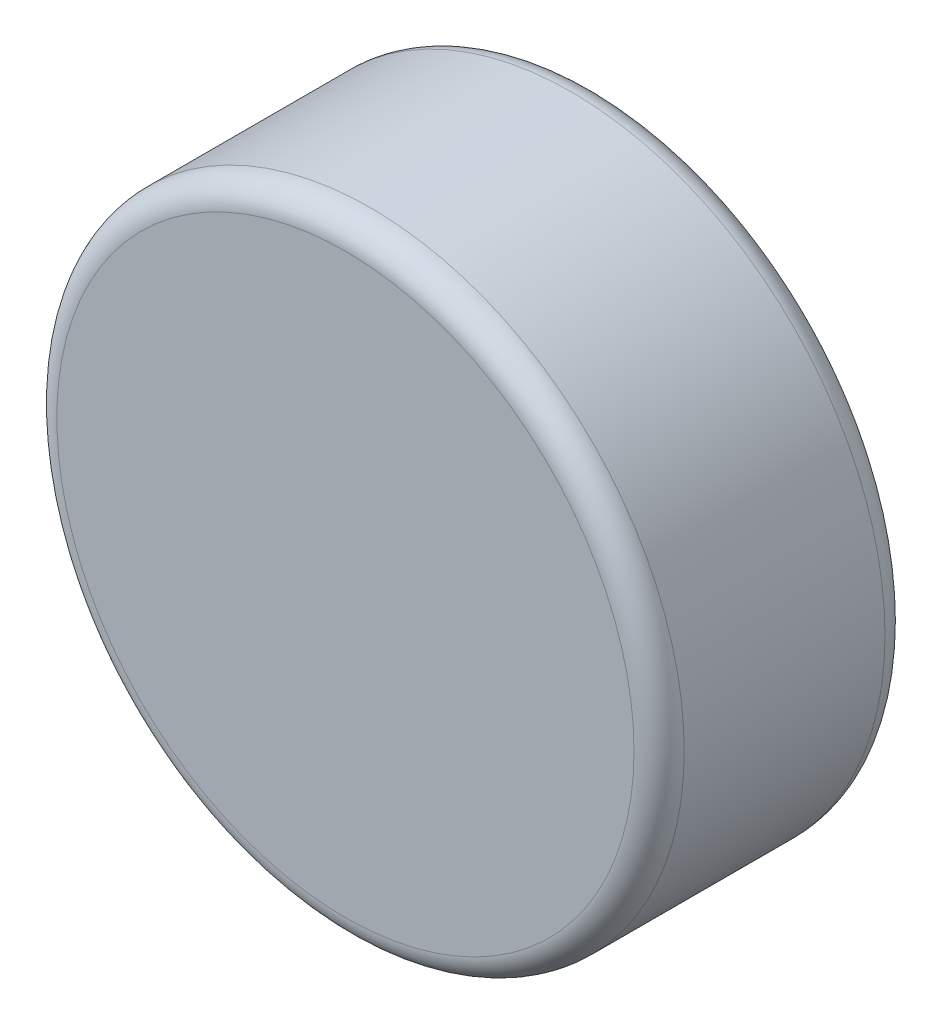
ISO-10303-21;
HEADER;
FILE_DESCRIPTION(('STEP AP214'),'2;1');
FILE_NAME('part.step','',(''),(''),'','','');
FILE_SCHEMA(('AUTOMOTIVE_DESIGN { 1 0 10303 214 1 1 1 1 }'));
ENDSEC;
DATA;
#1=APPLICATION_CONTEXT('core data for automotive mechanical design processes');
#2=APPLICATION_PROTOCOL_DEFINITION('international standard','automotive_design',2000,#1);
#3=PRODUCT_CONTEXT('',#1,'mechanical');
#4=PRODUCT('Part','Part','',(#3));
#5=PRODUCT_RELATED_PRODUCT_CATEGORY('part','',(#4));
#6=PRODUCT_DEFINITION_FORMATION('','',#4);
#7=PRODUCT_DEFINITION_CONTEXT('part definition',#1,'design');
#8=PRODUCT_DEFINITION('design','',#6,#7);
#9=PRODUCT_DEFINITION_SHAPE('','',#8);
#10=(LENGTH_UNIT() NAMED_UNIT(*) SI_UNIT(.MILLI.,.METRE.));
#11=(NAMED_UNIT(*) PLANE_ANGLE_UNIT() SI_UNIT($,.RADIAN.));
#12=(NAMED_UNIT(*) SI_UNIT($,.STERADIAN.) SOLID_ANGLE_UNIT());
#13=UNCERTAINTY_MEASURE_WITH_UNIT(LENGTH_MEASURE(1.E-05),#10,'distance_accuracy_value','');
#14=(GEOMETRIC_REPRESENTATION_CONTEXT(3) GLOBAL_UNCERTAINTY_ASSIGNED_CONTEXT((#13)) GLOBAL_UNIT_ASSIGNED_CONTEXT((#10,
#11,#12)) REPRESENTATION_CONTEXT('',''));
#15=CARTESIAN_POINT('',(0.,0.,0.));
#16=DIRECTION('',(0.,0.,1.));
#17=DIRECTION('',(1.,0.,0.));
#18=AXIS2_PLACEMENT_3D('',#15,#16,#17);
#19=CARTESIAN_POINT('',(0.,0.,2.));
#20=DIRECTION('',(0.,0.,-1.));
#21=DIRECTION('',(-1.,0.,0.));
#22=AXIS2_PLACEMENT_3D('',#19,#20,#21);
#23=CYLINDRICAL_SURFACE('',#22,2.5);
#24=CARTESIAN_POINT('',(0.,0.,1.8));
#25=DIRECTION('',(0.,0.,1.));
#26=DIRECTION('',(1.,0.,0.));
#27=AXIS2_PLACEMENT_3D('',#24,#25,#26);
#28=CIRCLE('',#27,2.5);
#29=CARTESIAN_POINT('',(2.5,0.,1.8));
#30=VERTEX_POINT('',#29);
#31=EDGE_CURVE('E41',#30,#30,#28,.F.);
#32=ORIENTED_EDGE('',*,*,#31,.T.);
#33=EDGE_LOOP('',(#32));
#34=FACE_BOUND('',#33,.T.);
#35=CARTESIAN_POINT('',(0.,0.,0.2));
#36=DIRECTION('',(0.,0.,1.));
#37=DIRECTION('',(1.,0.,0.));
#38=AXIS2_PLACEMENT_3D('',#35,#36,#37);
#39=CIRCLE('',#38,2.5);
#40=CARTESIAN_POINT('',(2.5,0.,0.2));
#41=VERTEX_POINT('',#40);
#42=EDGE_CURVE('E45',#41,#41,#39,.T.);
#43=ORIENTED_EDGE('',*,*,#42,.T.);
#44=EDGE_LOOP('',(#43));
#45=FACE_BOUND('',#44,.T.);
#46=ADVANCED_FACE('F34',(#34,#45),#23,.T.);
#47=CARTESIAN_POINT('',(0.,0.,2.));
#48=DIRECTION('',(0.,0.,1.));
#49=DIRECTION('',(1.,0.,0.));
#50=AXIS2_PLACEMENT_3D('',#47,#48,#49);
#51=PLANE('',#50);
#52=CARTESIAN_POINT('',(0.,0.,2.));
#53=DIRECTION('',(0.,0.,1.));
#54=DIRECTION('',(1.,0.,0.));
#55=AXIS2_PLACEMENT_3D('',#52,#53,#54);
#56=CIRCLE('',#55,2.3);
#57=CARTESIAN_POINT('',(2.3,0.,2.));
#58=VERTEX_POINT('',#57);
#59=EDGE_CURVE('E49',#58,#58,#56,.T.);
#60=ORIENTED_EDGE('',*,*,#59,.T.);
#61=EDGE_LOOP('',(#60));
#62=FACE_BOUND('',#61,.T.);
#63=ADVANCED_FACE('F55',(#62),#51,.T.);
#64=CARTESIAN_POINT('',(0.,0.,0.));
#65=DIRECTION('',(0.,0.,1.));
#66=DIRECTION('',(1.,0.,0.));
#67=AXIS2_PLACEMENT_3D('',#64,#65,#66);
#68=PLANE('',#67);
#69=CARTESIAN_POINT('',(0.,0.,0.));
#70=DIRECTION('',(0.,0.,1.));
#71=DIRECTION('',(1.,0.,0.));
#72=AXIS2_PLACEMENT_3D('',#69,#70,#71);
#73=CIRCLE('',#72,2.3);
#74=CARTESIAN_POINT('',(2.3,0.,0.));
#75=VERTEX_POINT('',#74);
#76=EDGE_CURVE('E10',#75,#75,#73,.F.);
#77=ORIENTED_EDGE('',*,*,#76,.T.);
#78=EDGE_LOOP('',(#77));
#79=FACE_BOUND('',#78,.T.);
#80=ADVANCED_FACE('F59',(#79),#68,.F.);
#81=CARTESIAN_POINT('',(0.,0.,1.8));
#82=DIRECTION('',(0.,0.,1.));
#83=DIRECTION('',(1.,0.,0.));
#84=AXIS2_PLACEMENT_3D('',#81,#82,#83);
#85=TOROIDAL_SURFACE('',#84,2.3,0.2);
#86=ORIENTED_EDGE('',*,*,#31,.F.);
#87=EDGE_LOOP('',(#86));
#88=FACE_BOUND('',#87,.T.);
#89=ORIENTED_EDGE('',*,*,#59,.F.);
#90=EDGE_LOOP('',(#89));
#91=FACE_BOUND('',#90,.T.);
#92=ADVANCED_FACE('F57',(#88,#91),#85,.T.);
#93=CARTESIAN_POINT('',(0.,0.,0.2));
#94=DIRECTION('',(0.,0.,1.));
#95=DIRECTION('',(1.,0.,0.));
#96=AXIS2_PLACEMENT_3D('',#93,#94,#95);
#97=TOROIDAL_SURFACE('',#96,2.3,0.2);
#98=ORIENTED_EDGE('',*,*,#76,.F.);
#99=EDGE_LOOP('',(#98));
#100=FACE_BOUND('',#99,.T.);
#101=ORIENTED_EDGE('',*,*,#42,.F.);
#102=EDGE_LOOP('',(#101));
#103=FACE_BOUND('',#102,.T.);
#104=ADVANCED_FACE('F36',(#100,#103),#97,.T.);
#105=CLOSED_SHELL('',(#46,#63,#80,#92,#104));
#106=MANIFOLD_SOLID_BREP('B2',#105);
#107=ADVANCED_BREP_SHAPE_REPRESENTATION('',(#18,#106),#14);
#108=SHAPE_DEFINITION_REPRESENTATION(#9,#107);
ENDSEC;
END-ISO-10303-21;
